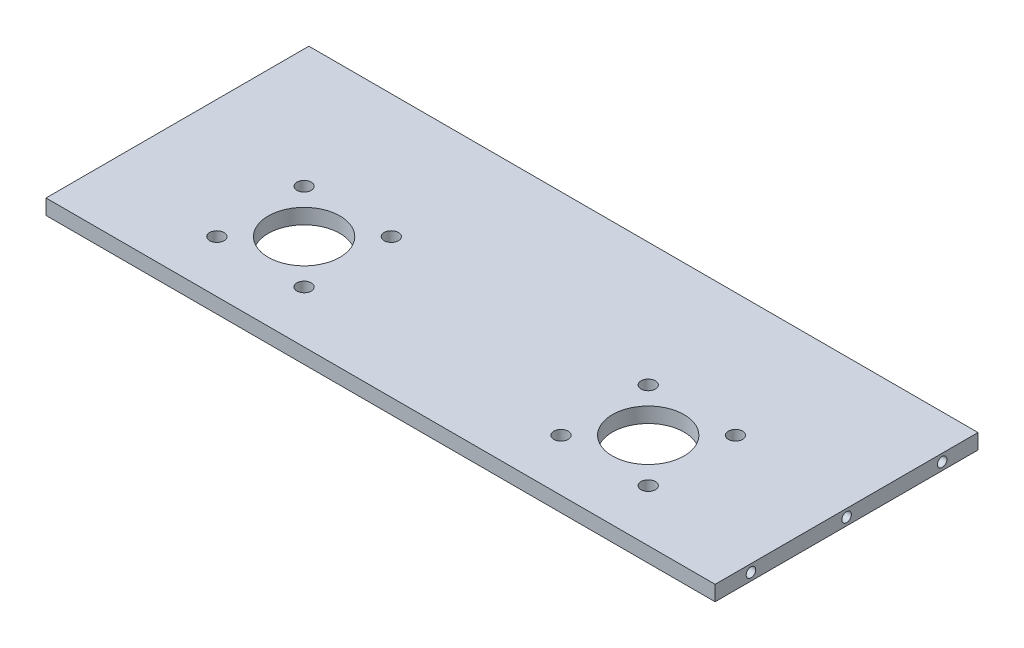
ISO-10303-21;
HEADER;
FILE_DESCRIPTION(('STEP AP214'),'2;1');
FILE_NAME('part.step','',(''),(''),'','','');
FILE_SCHEMA(('AUTOMOTIVE_DESIGN { 1 0 10303 214 1 1 1 1 }'));
ENDSEC;
DATA;
#1=APPLICATION_CONTEXT('core data for automotive mechanical design processes');
#2=APPLICATION_PROTOCOL_DEFINITION('international standard','automotive_design',2000,#1);
#3=PRODUCT_CONTEXT('',#1,'mechanical');
#4=PRODUCT('Part','Part','',(#3));
#5=PRODUCT_RELATED_PRODUCT_CATEGORY('part','',(#4));
#6=PRODUCT_DEFINITION_FORMATION('','',#4);
#7=PRODUCT_DEFINITION_CONTEXT('part definition',#1,'design');
#8=PRODUCT_DEFINITION('design','',#6,#7);
#9=PRODUCT_DEFINITION_SHAPE('','',#8);
#10=(LENGTH_UNIT() NAMED_UNIT(*) SI_UNIT(.MILLI.,.METRE.));
#11=(NAMED_UNIT(*) PLANE_ANGLE_UNIT() SI_UNIT($,.RADIAN.));
#12=(NAMED_UNIT(*) SI_UNIT($,.STERADIAN.) SOLID_ANGLE_UNIT());
#13=UNCERTAINTY_MEASURE_WITH_UNIT(LENGTH_MEASURE(1.E-05),#10,'distance_accuracy_value','');
#14=(GEOMETRIC_REPRESENTATION_CONTEXT(3) GLOBAL_UNCERTAINTY_ASSIGNED_CONTEXT((#13)) GLOBAL_UNIT_ASSIGNED_CONTEXT((#10,
#11,#12)) REPRESENTATION_CONTEXT('',''));
#15=CARTESIAN_POINT('',(0.,0.,0.));
#16=DIRECTION('',(0.,0.,1.));
#17=DIRECTION('',(1.,0.,0.));
#18=AXIS2_PLACEMENT_3D('',#15,#16,#17);
#19=CARTESIAN_POINT('',(0.,6.35,0.));
#20=DIRECTION('',(0.,1.,0.));
#21=DIRECTION('',(0.,0.,1.));
#22=AXIS2_PLACEMENT_3D('',#19,#20,#21);
#23=PLANE('',#22);
#24=CARTESIAN_POINT('',(104.544294294294,6.35,31.4932432432432));
#25=DIRECTION('',(0.,1.,0.));
#26=DIRECTION('',(0.,0.,1.));
#27=AXIS2_PLACEMENT_3D('',#24,#25,#26);
#28=CIRCLE('',#27,3.00000000000001);
#29=CARTESIAN_POINT('',(104.544294294294,6.35,34.4932432432432));
#30=VERTEX_POINT('',#29);
#31=EDGE_CURVE('E159',#30,#30,#28,.F.);
#32=ORIENTED_EDGE('',*,*,#31,.T.);
#33=EDGE_LOOP('',(#32));
#34=FACE_BOUND('',#33,.T.);
#35=CARTESIAN_POINT('',(104.544294294294,6.35,-5.00675675675667));
#36=DIRECTION('',(0.,1.,0.));
#37=DIRECTION('',(0.,0.,1.));
#38=AXIS2_PLACEMENT_3D('',#35,#36,#37);
#39=CIRCLE('',#38,3.00000000000001);
#40=CARTESIAN_POINT('',(104.544294294294,6.35,-2.00675675675666));
#41=VERTEX_POINT('',#40);
#42=EDGE_CURVE('E147',#41,#41,#39,.F.);
#43=ORIENTED_EDGE('',*,*,#42,.T.);
#44=EDGE_LOOP('',(#43));
#45=FACE_BOUND('',#44,.T.);
#46=CARTESIAN_POINT('',(-39.4557057057057,6.35,31.4932432432433));
#47=DIRECTION('',(0.,1.,0.));
#48=DIRECTION('',(0.,0.,1.));
#49=AXIS2_PLACEMENT_3D('',#46,#47,#48);
#50=CIRCLE('',#49,3.00000000000001);
#51=CARTESIAN_POINT('',(-39.4557057057057,6.35,34.4932432432433));
#52=VERTEX_POINT('',#51);
#53=EDGE_CURVE('E135',#52,#52,#50,.F.);
#54=ORIENTED_EDGE('',*,*,#53,.T.);
#55=EDGE_LOOP('',(#54));
#56=FACE_BOUND('',#55,.T.);
#57=CARTESIAN_POINT('',(86.2942942942943,6.35,13.2432432432432));
#58=DIRECTION('',(0.,1.,0.));
#59=DIRECTION('',(0.,0.,1.));
#60=AXIS2_PLACEMENT_3D('',#57,#58,#59);
#61=CIRCLE('',#60,15.);
#62=CARTESIAN_POINT('',(86.2942942942943,6.35,28.2432432432432));
#63=VERTEX_POINT('',#62);
#64=EDGE_CURVE('E123',#63,#63,#61,.F.);
#65=ORIENTED_EDGE('',*,*,#64,.T.);
#66=EDGE_LOOP('',(#65));
#67=FACE_BOUND('',#66,.T.);
#68=CARTESIAN_POINT('',(-39.4557057057057,6.35,-5.0067567567567));
#69=DIRECTION('',(0.,1.,0.));
#70=DIRECTION('',(0.,0.,1.));
#71=AXIS2_PLACEMENT_3D('',#68,#69,#70);
#72=CIRCLE('',#71,3.00000000000001);
#73=CARTESIAN_POINT('',(-39.4557057057057,6.35,-2.00675675675669));
#74=VERTEX_POINT('',#73);
#75=EDGE_CURVE('E100',#74,#74,#72,.F.);
#76=ORIENTED_EDGE('',*,*,#75,.T.);
#77=EDGE_LOOP('',(#76));
#78=FACE_BOUND('',#77,.T.);
#79=DIRECTION('',(0.,0.,1.));
#80=VECTOR('',#79,1.);
#81=CARTESIAN_POINT('',(-125.705705705706,6.35,-56.7567567567568));
#82=LINE('',#81,#80);
#83=CARTESIAN_POINT('',(-125.705705705706,6.35,-56.7567567567568));
#84=VERTEX_POINT('',#83);
#85=CARTESIAN_POINT('',(-125.705705705706,6.35,53.2432432432432));
#86=VERTEX_POINT('',#85);
#87=EDGE_CURVE('E85',#84,#86,#82,.T.);
#88=ORIENTED_EDGE('',*,*,#87,.T.);
#89=DIRECTION('',(1.,0.,0.));
#90=VECTOR('',#89,1.);
#91=CARTESIAN_POINT('',(-125.705705705706,6.35,53.2432432432432));
#92=LINE('',#91,#90);
#93=CARTESIAN_POINT('',(154.294294294294,6.35,53.2432432432432));
#94=VERTEX_POINT('',#93);
#95=EDGE_CURVE('E80',#86,#94,#92,.T.);
#96=ORIENTED_EDGE('',*,*,#95,.T.);
#97=DIRECTION('',(0.,0.,-1.));
#98=VECTOR('',#97,1.);
#99=CARTESIAN_POINT('',(154.294294294294,6.35,-56.7567567567568));
#100=LINE('',#99,#98);
#101=CARTESIAN_POINT('',(154.294294294294,6.35,-56.7567567567568));
#102=VERTEX_POINT('',#101);
#103=EDGE_CURVE('E83',#94,#102,#100,.T.);
#104=ORIENTED_EDGE('',*,*,#103,.T.);
#105=DIRECTION('',(-1.,0.,0.));
#106=VECTOR('',#105,1.);
#107=CARTESIAN_POINT('',(-125.705705705706,6.35,-56.7567567567568));
#108=LINE('',#107,#106);
#109=EDGE_CURVE('E50',#102,#84,#108,.T.);
#110=ORIENTED_EDGE('',*,*,#109,.T.);
#111=EDGE_LOOP('',(#88,#96,#104,#110));
#112=FACE_BOUND('',#111,.T.);
#113=CARTESIAN_POINT('',(-75.9557057057057,6.35,-5.00675675675669));
#114=DIRECTION('',(0.,1.,0.));
#115=DIRECTION('',(0.,0.,1.));
#116=AXIS2_PLACEMENT_3D('',#113,#114,#115);
#117=CIRCLE('',#116,3.00000000000001);
#118=CARTESIAN_POINT('',(-75.9557057057057,6.35,-2.00675675675669));
#119=VERTEX_POINT('',#118);
#120=EDGE_CURVE('E117',#119,#119,#117,.F.);
#121=ORIENTED_EDGE('',*,*,#120,.T.);
#122=EDGE_LOOP('',(#121));
#123=FACE_BOUND('',#122,.T.);
#124=CARTESIAN_POINT('',(-57.7057057057057,6.35,13.2432432432433));
#125=DIRECTION('',(0.,1.,0.));
#126=DIRECTION('',(0.,0.,1.));
#127=AXIS2_PLACEMENT_3D('',#124,#125,#126);
#128=CIRCLE('',#127,15.);
#129=CARTESIAN_POINT('',(-57.7057057057057,6.35,28.2432432432432));
#130=VERTEX_POINT('',#129);
#131=EDGE_CURVE('E129',#130,#130,#128,.F.);
#132=ORIENTED_EDGE('',*,*,#131,.T.);
#133=EDGE_LOOP('',(#132));
#134=FACE_BOUND('',#133,.T.);
#135=CARTESIAN_POINT('',(-75.9557057057057,6.35,31.4932432432433));
#136=DIRECTION('',(0.,1.,0.));
#137=DIRECTION('',(0.,0.,1.));
#138=AXIS2_PLACEMENT_3D('',#135,#136,#137);
#139=CIRCLE('',#138,3.00000000000001);
#140=CARTESIAN_POINT('',(-75.9557057057057,6.35,34.4932432432433));
#141=VERTEX_POINT('',#140);
#142=EDGE_CURVE('E141',#141,#141,#139,.F.);
#143=ORIENTED_EDGE('',*,*,#142,.T.);
#144=EDGE_LOOP('',(#143));
#145=FACE_BOUND('',#144,.T.);
#146=CARTESIAN_POINT('',(68.0442942942943,6.35,-5.00675675675667));
#147=DIRECTION('',(0.,1.,0.));
#148=DIRECTION('',(0.,0.,1.));
#149=AXIS2_PLACEMENT_3D('',#146,#147,#148);
#150=CIRCLE('',#149,3.00000000000001);
#151=CARTESIAN_POINT('',(68.0442942942943,6.35,-2.00675675675666));
#152=VERTEX_POINT('',#151);
#153=EDGE_CURVE('E153',#152,#152,#150,.F.);
#154=ORIENTED_EDGE('',*,*,#153,.T.);
#155=EDGE_LOOP('',(#154));
#156=FACE_BOUND('',#155,.T.);
#157=CARTESIAN_POINT('',(68.0442942942943,6.35,31.4932432432432));
#158=DIRECTION('',(0.,1.,0.));
#159=DIRECTION('',(0.,0.,1.));
#160=AXIS2_PLACEMENT_3D('',#157,#158,#159);
#161=CIRCLE('',#160,3.00000000000001);
#162=CARTESIAN_POINT('',(68.0442942942943,6.35,34.4932432432432));
#163=VERTEX_POINT('',#162);
#164=EDGE_CURVE('E165',#163,#163,#161,.F.);
#165=ORIENTED_EDGE('',*,*,#164,.T.);
#166=EDGE_LOOP('',(#165));
#167=FACE_BOUND('',#166,.T.);
#168=ADVANCED_FACE('F33',(#34,#45,#56,#67,#78,#112,#123,#134,#145,#156,#167),#23,.T.);
#169=CARTESIAN_POINT('',(0.,0.,0.));
#170=DIRECTION('',(0.,1.,0.));
#171=DIRECTION('',(0.,0.,1.));
#172=AXIS2_PLACEMENT_3D('',#169,#170,#171);
#173=PLANE('',#172);
#174=CARTESIAN_POINT('',(104.544294294294,0.,31.4932432432432));
#175=DIRECTION('',(0.,1.,0.));
#176=DIRECTION('',(0.,0.,1.));
#177=AXIS2_PLACEMENT_3D('',#174,#175,#176);
#178=CIRCLE('',#177,3.00000000000001);
#179=CARTESIAN_POINT('',(104.544294294294,0.,34.4932432432432));
#180=VERTEX_POINT('',#179);
#181=EDGE_CURVE('E162',#180,#180,#178,.T.);
#182=ORIENTED_EDGE('',*,*,#181,.T.);
#183=EDGE_LOOP('',(#182));
#184=FACE_BOUND('',#183,.T.);
#185=CARTESIAN_POINT('',(104.544294294294,0.,-5.00675675675667));
#186=DIRECTION('',(0.,1.,0.));
#187=DIRECTION('',(0.,0.,1.));
#188=AXIS2_PLACEMENT_3D('',#185,#186,#187);
#189=CIRCLE('',#188,3.00000000000001);
#190=CARTESIAN_POINT('',(104.544294294294,0.,-2.00675675675666));
#191=VERTEX_POINT('',#190);
#192=EDGE_CURVE('E150',#191,#191,#189,.T.);
#193=ORIENTED_EDGE('',*,*,#192,.T.);
#194=EDGE_LOOP('',(#193));
#195=FACE_BOUND('',#194,.T.);
#196=CARTESIAN_POINT('',(-39.4557057057057,0.,31.4932432432433));
#197=DIRECTION('',(0.,1.,0.));
#198=DIRECTION('',(0.,0.,1.));
#199=AXIS2_PLACEMENT_3D('',#196,#197,#198);
#200=CIRCLE('',#199,3.00000000000001);
#201=CARTESIAN_POINT('',(-39.4557057057057,0.,34.4932432432433));
#202=VERTEX_POINT('',#201);
#203=EDGE_CURVE('E138',#202,#202,#200,.T.);
#204=ORIENTED_EDGE('',*,*,#203,.T.);
#205=EDGE_LOOP('',(#204));
#206=FACE_BOUND('',#205,.T.);
#207=CARTESIAN_POINT('',(86.2942942942943,0.,13.2432432432432));
#208=DIRECTION('',(0.,1.,0.));
#209=DIRECTION('',(0.,0.,1.));
#210=AXIS2_PLACEMENT_3D('',#207,#208,#209);
#211=CIRCLE('',#210,15.);
#212=CARTESIAN_POINT('',(86.2942942942943,0.,28.2432432432432));
#213=VERTEX_POINT('',#212);
#214=EDGE_CURVE('E126',#213,#213,#211,.T.);
#215=ORIENTED_EDGE('',*,*,#214,.T.);
#216=EDGE_LOOP('',(#215));
#217=FACE_BOUND('',#216,.T.);
#218=CARTESIAN_POINT('',(-39.4557057057057,0.,-5.0067567567567));
#219=DIRECTION('',(0.,1.,0.));
#220=DIRECTION('',(0.,0.,1.));
#221=AXIS2_PLACEMENT_3D('',#218,#219,#220);
#222=CIRCLE('',#221,3.00000000000001);
#223=CARTESIAN_POINT('',(-39.4557057057057,0.,-2.00675675675669));
#224=VERTEX_POINT('',#223);
#225=EDGE_CURVE('E114',#224,#224,#222,.T.);
#226=ORIENTED_EDGE('',*,*,#225,.T.);
#227=EDGE_LOOP('',(#226));
#228=FACE_BOUND('',#227,.T.);
#229=DIRECTION('',(0.,0.,1.));
#230=VECTOR('',#229,1.);
#231=CARTESIAN_POINT('',(-125.705705705706,0.,-56.7567567567568));
#232=LINE('',#231,#230);
#233=CARTESIAN_POINT('',(-125.705705705706,0.,-56.7567567567568));
#234=VERTEX_POINT('',#233);
#235=CARTESIAN_POINT('',(-125.705705705706,0.,53.2432432432432));
#236=VERTEX_POINT('',#235);
#237=EDGE_CURVE('E97',#234,#236,#232,.T.);
#238=ORIENTED_EDGE('',*,*,#237,.F.);
#239=DIRECTION('',(-1.,0.,0.));
#240=VECTOR('',#239,1.);
#241=CARTESIAN_POINT('',(-125.705705705706,0.,-56.7567567567568));
#242=LINE('',#241,#240);
#243=CARTESIAN_POINT('',(154.294294294294,0.,-56.7567567567568));
#244=VERTEX_POINT('',#243);
#245=EDGE_CURVE('E73',#244,#234,#242,.T.);
#246=ORIENTED_EDGE('',*,*,#245,.F.);
#247=DIRECTION('',(0.,0.,-1.));
#248=VECTOR('',#247,1.);
#249=CARTESIAN_POINT('',(154.294294294294,0.,-56.7567567567568));
#250=LINE('',#249,#248);
#251=CARTESIAN_POINT('',(154.294294294294,0.,53.2432432432432));
#252=VERTEX_POINT('',#251);
#253=EDGE_CURVE('E67',#252,#244,#250,.T.);
#254=ORIENTED_EDGE('',*,*,#253,.F.);
#255=DIRECTION('',(1.,0.,0.));
#256=VECTOR('',#255,1.);
#257=CARTESIAN_POINT('',(-125.705705705706,0.,53.2432432432432));
#258=LINE('',#257,#256);
#259=EDGE_CURVE('E89',#236,#252,#258,.T.);
#260=ORIENTED_EDGE('',*,*,#259,.F.);
#261=EDGE_LOOP('',(#238,#246,#254,#260));
#262=FACE_BOUND('',#261,.T.);
#263=CARTESIAN_POINT('',(-75.9557057057057,0.,-5.00675675675669));
#264=DIRECTION('',(0.,1.,0.));
#265=DIRECTION('',(0.,0.,1.));
#266=AXIS2_PLACEMENT_3D('',#263,#264,#265);
#267=CIRCLE('',#266,3.00000000000001);
#268=CARTESIAN_POINT('',(-75.9557057057057,0.,-2.00675675675669));
#269=VERTEX_POINT('',#268);
#270=EDGE_CURVE('E120',#269,#269,#267,.T.);
#271=ORIENTED_EDGE('',*,*,#270,.T.);
#272=EDGE_LOOP('',(#271));
#273=FACE_BOUND('',#272,.T.);
#274=CARTESIAN_POINT('',(-57.7057057057057,0.,13.2432432432433));
#275=DIRECTION('',(0.,1.,0.));
#276=DIRECTION('',(0.,0.,1.));
#277=AXIS2_PLACEMENT_3D('',#274,#275,#276);
#278=CIRCLE('',#277,15.);
#279=CARTESIAN_POINT('',(-57.7057057057057,0.,28.2432432432432));
#280=VERTEX_POINT('',#279);
#281=EDGE_CURVE('E132',#280,#280,#278,.T.);
#282=ORIENTED_EDGE('',*,*,#281,.T.);
#283=EDGE_LOOP('',(#282));
#284=FACE_BOUND('',#283,.T.);
#285=CARTESIAN_POINT('',(-75.9557057057057,0.,31.4932432432433));
#286=DIRECTION('',(0.,1.,0.));
#287=DIRECTION('',(0.,0.,1.));
#288=AXIS2_PLACEMENT_3D('',#285,#286,#287);
#289=CIRCLE('',#288,3.00000000000001);
#290=CARTESIAN_POINT('',(-75.9557057057057,0.,34.4932432432433));
#291=VERTEX_POINT('',#290);
#292=EDGE_CURVE('E144',#291,#291,#289,.T.);
#293=ORIENTED_EDGE('',*,*,#292,.T.);
#294=EDGE_LOOP('',(#293));
#295=FACE_BOUND('',#294,.T.);
#296=CARTESIAN_POINT('',(68.0442942942943,0.,-5.00675675675667));
#297=DIRECTION('',(0.,1.,0.));
#298=DIRECTION('',(0.,0.,1.));
#299=AXIS2_PLACEMENT_3D('',#296,#297,#298);
#300=CIRCLE('',#299,3.00000000000001);
#301=CARTESIAN_POINT('',(68.0442942942943,0.,-2.00675675675666));
#302=VERTEX_POINT('',#301);
#303=EDGE_CURVE('E156',#302,#302,#300,.T.);
#304=ORIENTED_EDGE('',*,*,#303,.T.);
#305=EDGE_LOOP('',(#304));
#306=FACE_BOUND('',#305,.T.);
#307=CARTESIAN_POINT('',(68.0442942942943,0.,31.4932432432432));
#308=DIRECTION('',(0.,1.,0.));
#309=DIRECTION('',(0.,0.,1.));
#310=AXIS2_PLACEMENT_3D('',#307,#308,#309);
#311=CIRCLE('',#310,3.00000000000001);
#312=CARTESIAN_POINT('',(68.0442942942943,0.,34.4932432432432));
#313=VERTEX_POINT('',#312);
#314=EDGE_CURVE('E168',#313,#313,#311,.T.);
#315=ORIENTED_EDGE('',*,*,#314,.T.);
#316=EDGE_LOOP('',(#315));
#317=FACE_BOUND('',#316,.T.);
#318=ADVANCED_FACE('F108',(#184,#195,#206,#217,#228,#262,#273,#284,#295,#306,#317),#173,.F.);
#319=CARTESIAN_POINT('',(-125.705705705706,6.35,-56.7567567567568));
#320=DIRECTION('',(1.,0.,0.));
#321=DIRECTION('',(0.,0.,-1.));
#322=AXIS2_PLACEMENT_3D('',#319,#320,#321);
#323=PLANE('',#322);
#324=CARTESIAN_POINT('',(-125.705705705706,3.175,-1.75675675675677));
#325=DIRECTION('',(-1.,0.,0.));
#326=DIRECTION('',(0.,0.,1.));
#327=AXIS2_PLACEMENT_3D('',#324,#325,#326);
#328=CIRCLE('',#327,2.);
#329=CARTESIAN_POINT('',(-125.705705705706,3.175,0.24324324324323));
#330=VERTEX_POINT('',#329);
#331=EDGE_CURVE('E184',#330,#330,#328,.T.);
#332=ORIENTED_EDGE('',*,*,#331,.F.);
#333=EDGE_LOOP('',(#332));
#334=FACE_BOUND('',#333,.T.);
#335=CARTESIAN_POINT('',(-125.705705705706,3.175,-41.7567567567568));
#336=DIRECTION('',(-1.,0.,0.));
#337=DIRECTION('',(0.,0.,1.));
#338=AXIS2_PLACEMENT_3D('',#335,#336,#337);
#339=CIRCLE('',#338,2.);
#340=CARTESIAN_POINT('',(-125.705705705706,3.175,-39.7567567567568));
#341=VERTEX_POINT('',#340);
#342=EDGE_CURVE('E178',#341,#341,#339,.T.);
#343=ORIENTED_EDGE('',*,*,#342,.F.);
#344=EDGE_LOOP('',(#343));
#345=FACE_BOUND('',#344,.T.);
#346=CARTESIAN_POINT('',(-125.705705705706,3.175,38.2432432432432));
#347=DIRECTION('',(-1.,0.,0.));
#348=DIRECTION('',(0.,0.,1.));
#349=AXIS2_PLACEMENT_3D('',#346,#347,#348);
#350=CIRCLE('',#349,2.);
#351=CARTESIAN_POINT('',(-125.705705705706,3.175,40.2432432432432));
#352=VERTEX_POINT('',#351);
#353=EDGE_CURVE('E172',#352,#352,#350,.T.);
#354=ORIENTED_EDGE('',*,*,#353,.F.);
#355=EDGE_LOOP('',(#354));
#356=FACE_BOUND('',#355,.T.);
#357=ORIENTED_EDGE('',*,*,#237,.T.);
#358=DIRECTION('',(0.,-1.,0.));
#359=VECTOR('',#358,1.);
#360=CARTESIAN_POINT('',(-125.705705705706,6.35,53.2432432432432));
#361=LINE('',#360,#359);
#362=EDGE_CURVE('E11',#86,#236,#361,.T.);
#363=ORIENTED_EDGE('',*,*,#362,.F.);
#364=ORIENTED_EDGE('',*,*,#87,.F.);
#365=DIRECTION('',(0.,-1.,0.));
#366=VECTOR('',#365,1.);
#367=CARTESIAN_POINT('',(-125.705705705706,6.35,-56.7567567567568));
#368=LINE('',#367,#366);
#369=EDGE_CURVE('E93',#84,#234,#368,.T.);
#370=ORIENTED_EDGE('',*,*,#369,.T.);
#371=EDGE_LOOP('',(#357,#363,#364,#370));
#372=FACE_BOUND('',#371,.T.);
#373=ADVANCED_FACE('F35',(#334,#345,#356,#372),#323,.F.);
#374=CARTESIAN_POINT('',(-125.705705705706,6.35,53.2432432432432));
#375=DIRECTION('',(0.,0.,-1.));
#376=DIRECTION('',(-1.,0.,0.));
#377=AXIS2_PLACEMENT_3D('',#374,#375,#376);
#378=PLANE('',#377);
#379=ORIENTED_EDGE('',*,*,#259,.T.);
#380=DIRECTION('',(0.,-1.,0.));
#381=VECTOR('',#380,1.);
#382=CARTESIAN_POINT('',(154.294294294294,6.35,53.2432432432432));
#383=LINE('',#382,#381);
#384=EDGE_CURVE('E42',#94,#252,#383,.T.);
#385=ORIENTED_EDGE('',*,*,#384,.F.);
#386=ORIENTED_EDGE('',*,*,#95,.F.);
#387=ORIENTED_EDGE('',*,*,#362,.T.);
#388=EDGE_LOOP('',(#379,#385,#386,#387));
#389=FACE_BOUND('',#388,.T.);
#390=ADVANCED_FACE('F88',(#389),#378,.F.);
#391=CARTESIAN_POINT('',(154.294294294294,6.35,-56.7567567567568));
#392=DIRECTION('',(-1.,0.,0.));
#393=DIRECTION('',(0.,0.,1.));
#394=AXIS2_PLACEMENT_3D('',#391,#392,#393);
#395=PLANE('',#394);
#396=CARTESIAN_POINT('',(154.294294294294,3.175,-1.75675675675676));
#397=DIRECTION('',(1.,0.,0.));
#398=DIRECTION('',(0.,0.,-1.));
#399=AXIS2_PLACEMENT_3D('',#396,#397,#398);
#400=CIRCLE('',#399,2.);
#401=CARTESIAN_POINT('',(154.294294294294,3.175,-3.75675675675676));
#402=VERTEX_POINT('',#401);
#403=EDGE_CURVE('E202',#402,#402,#400,.T.);
#404=ORIENTED_EDGE('',*,*,#403,.F.);
#405=EDGE_LOOP('',(#404));
#406=FACE_BOUND('',#405,.T.);
#407=CARTESIAN_POINT('',(154.294294294294,3.175,38.2432432432432));
#408=DIRECTION('',(1.,0.,0.));
#409=DIRECTION('',(0.,0.,-1.));
#410=AXIS2_PLACEMENT_3D('',#407,#408,#409);
#411=CIRCLE('',#410,2.);
#412=CARTESIAN_POINT('',(154.294294294294,3.175,36.2432432432432));
#413=VERTEX_POINT('',#412);
#414=EDGE_CURVE('E196',#413,#413,#411,.T.);
#415=ORIENTED_EDGE('',*,*,#414,.F.);
#416=EDGE_LOOP('',(#415));
#417=FACE_BOUND('',#416,.T.);
#418=CARTESIAN_POINT('',(154.294294294294,3.175,-41.7567567567568));
#419=DIRECTION('',(1.,0.,0.));
#420=DIRECTION('',(0.,0.,-1.));
#421=AXIS2_PLACEMENT_3D('',#418,#419,#420);
#422=CIRCLE('',#421,2.);
#423=CARTESIAN_POINT('',(154.294294294294,3.175,-43.7567567567568));
#424=VERTEX_POINT('',#423);
#425=EDGE_CURVE('E190',#424,#424,#422,.T.);
#426=ORIENTED_EDGE('',*,*,#425,.F.);
#427=EDGE_LOOP('',(#426));
#428=FACE_BOUND('',#427,.T.);
#429=ORIENTED_EDGE('',*,*,#253,.T.);
#430=DIRECTION('',(0.,-1.,0.));
#431=VECTOR('',#430,1.);
#432=CARTESIAN_POINT('',(154.294294294294,6.35,-56.7567567567568));
#433=LINE('',#432,#431);
#434=EDGE_CURVE('E90',#102,#244,#433,.T.);
#435=ORIENTED_EDGE('',*,*,#434,.F.);
#436=ORIENTED_EDGE('',*,*,#103,.F.);
#437=ORIENTED_EDGE('',*,*,#384,.T.);
#438=EDGE_LOOP('',(#429,#435,#436,#437));
#439=FACE_BOUND('',#438,.T.);
#440=ADVANCED_FACE('F91',(#406,#417,#428,#439),#395,.F.);
#441=CARTESIAN_POINT('',(-125.705705705706,6.35,-56.7567567567568));
#442=DIRECTION('',(0.,0.,1.));
#443=DIRECTION('',(1.,0.,0.));
#444=AXIS2_PLACEMENT_3D('',#441,#442,#443);
#445=PLANE('',#444);
#446=ORIENTED_EDGE('',*,*,#245,.T.);
#447=ORIENTED_EDGE('',*,*,#369,.F.);
#448=ORIENTED_EDGE('',*,*,#109,.F.);
#449=ORIENTED_EDGE('',*,*,#434,.T.);
#450=EDGE_LOOP('',(#446,#447,#448,#449));
#451=FACE_BOUND('',#450,.T.);
#452=ADVANCED_FACE('F105',(#451),#445,.F.);
#453=CARTESIAN_POINT('',(-39.4557057057057,20.,-5.0067567567567));
#454=DIRECTION('',(0.,-1.,0.));
#455=DIRECTION('',(0.,0.,-1.));
#456=AXIS2_PLACEMENT_3D('',#453,#454,#455);
#457=CYLINDRICAL_SURFACE('',#456,3.00000000000001);
#458=ORIENTED_EDGE('',*,*,#75,.F.);
#459=EDGE_LOOP('',(#458));
#460=FACE_BOUND('',#459,.T.);
#461=ORIENTED_EDGE('',*,*,#225,.F.);
#462=EDGE_LOOP('',(#461));
#463=FACE_BOUND('',#462,.T.);
#464=ADVANCED_FACE('F251',(#460,#463),#457,.F.);
#465=CARTESIAN_POINT('',(-75.9557057057057,20.,-5.00675675675669));
#466=DIRECTION('',(0.,-1.,0.));
#467=DIRECTION('',(0.,0.,-1.));
#468=AXIS2_PLACEMENT_3D('',#465,#466,#467);
#469=CYLINDRICAL_SURFACE('',#468,3.00000000000001);
#470=ORIENTED_EDGE('',*,*,#120,.F.);
#471=EDGE_LOOP('',(#470));
#472=FACE_BOUND('',#471,.T.);
#473=ORIENTED_EDGE('',*,*,#270,.F.);
#474=EDGE_LOOP('',(#473));
#475=FACE_BOUND('',#474,.T.);
#476=ADVANCED_FACE('F312',(#472,#475),#469,.F.);
#477=CARTESIAN_POINT('',(86.2942942942943,20.,13.2432432432432));
#478=DIRECTION('',(0.,-1.,0.));
#479=DIRECTION('',(0.,0.,-1.));
#480=AXIS2_PLACEMENT_3D('',#477,#478,#479);
#481=CYLINDRICAL_SURFACE('',#480,15.);
#482=ORIENTED_EDGE('',*,*,#64,.F.);
#483=EDGE_LOOP('',(#482));
#484=FACE_BOUND('',#483,.T.);
#485=ORIENTED_EDGE('',*,*,#214,.F.);
#486=EDGE_LOOP('',(#485));
#487=FACE_BOUND('',#486,.T.);
#488=ADVANCED_FACE('F309',(#484,#487),#481,.F.);
#489=CARTESIAN_POINT('',(-57.7057057057057,20.,13.2432432432433));
#490=DIRECTION('',(0.,-1.,0.));
#491=DIRECTION('',(0.,0.,-1.));
#492=AXIS2_PLACEMENT_3D('',#489,#490,#491);
#493=CYLINDRICAL_SURFACE('',#492,15.);
#494=ORIENTED_EDGE('',*,*,#131,.F.);
#495=EDGE_LOOP('',(#494));
#496=FACE_BOUND('',#495,.T.);
#497=ORIENTED_EDGE('',*,*,#281,.F.);
#498=EDGE_LOOP('',(#497));
#499=FACE_BOUND('',#498,.T.);
#500=ADVANCED_FACE('F305',(#496,#499),#493,.F.);
#501=CARTESIAN_POINT('',(-39.4557057057057,20.,31.4932432432433));
#502=DIRECTION('',(0.,-1.,0.));
#503=DIRECTION('',(0.,0.,-1.));
#504=AXIS2_PLACEMENT_3D('',#501,#502,#503);
#505=CYLINDRICAL_SURFACE('',#504,3.00000000000001);
#506=ORIENTED_EDGE('',*,*,#53,.F.);
#507=EDGE_LOOP('',(#506));
#508=FACE_BOUND('',#507,.T.);
#509=ORIENTED_EDGE('',*,*,#203,.F.);
#510=EDGE_LOOP('',(#509));
#511=FACE_BOUND('',#510,.T.);
#512=ADVANCED_FACE('F301',(#508,#511),#505,.F.);
#513=CARTESIAN_POINT('',(-75.9557057057057,20.,31.4932432432433));
#514=DIRECTION('',(0.,-1.,0.));
#515=DIRECTION('',(0.,0.,-1.));
#516=AXIS2_PLACEMENT_3D('',#513,#514,#515);
#517=CYLINDRICAL_SURFACE('',#516,3.00000000000001);
#518=ORIENTED_EDGE('',*,*,#142,.F.);
#519=EDGE_LOOP('',(#518));
#520=FACE_BOUND('',#519,.T.);
#521=ORIENTED_EDGE('',*,*,#292,.F.);
#522=EDGE_LOOP('',(#521));
#523=FACE_BOUND('',#522,.T.);
#524=ADVANCED_FACE('F297',(#520,#523),#517,.F.);
#525=CARTESIAN_POINT('',(104.544294294294,20.,-5.00675675675667));
#526=DIRECTION('',(0.,-1.,0.));
#527=DIRECTION('',(0.,0.,-1.));
#528=AXIS2_PLACEMENT_3D('',#525,#526,#527);
#529=CYLINDRICAL_SURFACE('',#528,3.00000000000001);
#530=ORIENTED_EDGE('',*,*,#42,.F.);
#531=EDGE_LOOP('',(#530));
#532=FACE_BOUND('',#531,.T.);
#533=ORIENTED_EDGE('',*,*,#192,.F.);
#534=EDGE_LOOP('',(#533));
#535=FACE_BOUND('',#534,.T.);
#536=ADVANCED_FACE('F293',(#532,#535),#529,.F.);
#537=CARTESIAN_POINT('',(68.0442942942943,20.,-5.00675675675667));
#538=DIRECTION('',(0.,-1.,0.));
#539=DIRECTION('',(0.,0.,-1.));
#540=AXIS2_PLACEMENT_3D('',#537,#538,#539);
#541=CYLINDRICAL_SURFACE('',#540,3.00000000000001);
#542=ORIENTED_EDGE('',*,*,#153,.F.);
#543=EDGE_LOOP('',(#542));
#544=FACE_BOUND('',#543,.T.);
#545=ORIENTED_EDGE('',*,*,#303,.F.);
#546=EDGE_LOOP('',(#545));
#547=FACE_BOUND('',#546,.T.);
#548=ADVANCED_FACE('F289',(#544,#547),#541,.F.);
#549=CARTESIAN_POINT('',(104.544294294294,20.,31.4932432432432));
#550=DIRECTION('',(0.,-1.,0.));
#551=DIRECTION('',(0.,0.,-1.));
#552=AXIS2_PLACEMENT_3D('',#549,#550,#551);
#553=CYLINDRICAL_SURFACE('',#552,3.00000000000001);
#554=ORIENTED_EDGE('',*,*,#31,.F.);
#555=EDGE_LOOP('',(#554));
#556=FACE_BOUND('',#555,.T.);
#557=ORIENTED_EDGE('',*,*,#181,.F.);
#558=EDGE_LOOP('',(#557));
#559=FACE_BOUND('',#558,.T.);
#560=ADVANCED_FACE('F281',(#556,#559),#553,.F.);
#561=CARTESIAN_POINT('',(68.0442942942943,20.,31.4932432432432));
#562=DIRECTION('',(0.,-1.,0.));
#563=DIRECTION('',(0.,0.,-1.));
#564=AXIS2_PLACEMENT_3D('',#561,#562,#563);
#565=CYLINDRICAL_SURFACE('',#564,3.00000000000001);
#566=ORIENTED_EDGE('',*,*,#164,.F.);
#567=EDGE_LOOP('',(#566));
#568=FACE_BOUND('',#567,.T.);
#569=ORIENTED_EDGE('',*,*,#314,.F.);
#570=EDGE_LOOP('',(#569));
#571=FACE_BOUND('',#570,.T.);
#572=ADVANCED_FACE('F271',(#568,#571),#565,.F.);
#573=CARTESIAN_POINT('',(-95.7057057057057,3.175,38.2432432432432));
#574=DIRECTION('',(-1.,0.,0.));
#575=DIRECTION('',(0.,0.,1.));
#576=AXIS2_PLACEMENT_3D('',#573,#574,#575);
#577=CYLINDRICAL_SURFACE('',#576,2.);
#578=CARTESIAN_POINT('',(-95.7057057057057,3.175,38.2432432432432));
#579=DIRECTION('',(-1.,0.,0.));
#580=DIRECTION('',(0.,0.,1.));
#581=AXIS2_PLACEMENT_3D('',#578,#579,#580);
#582=CIRCLE('',#581,2.);
#583=CARTESIAN_POINT('',(-95.7057057057057,3.175,40.2432432432432));
#584=VERTEX_POINT('',#583);
#585=EDGE_CURVE('E171',#584,#584,#582,.T.);
#586=ORIENTED_EDGE('',*,*,#585,.F.);
#587=EDGE_LOOP('',(#586));
#588=FACE_BOUND('',#587,.T.);
#589=ORIENTED_EDGE('',*,*,#353,.T.);
#590=EDGE_LOOP('',(#589));
#591=FACE_BOUND('',#590,.T.);
#592=ADVANCED_FACE('F268',(#588,#591),#577,.F.);
#593=CARTESIAN_POINT('',(-95.7057057057057,3.175,38.2432432432432));
#594=DIRECTION('',(-1.,0.,0.));
#595=DIRECTION('',(0.,0.,1.));
#596=AXIS2_PLACEMENT_3D('',#593,#594,#595);
#597=PLANE('',#596);
#598=ORIENTED_EDGE('',*,*,#585,.T.);
#599=EDGE_LOOP('',(#598));
#600=FACE_BOUND('',#599,.T.);
#601=ADVANCED_FACE('F270',(#600),#597,.T.);
#602=CARTESIAN_POINT('',(-95.7057057057057,3.175,-41.7567567567568));
#603=DIRECTION('',(-1.,0.,0.));
#604=DIRECTION('',(0.,0.,1.));
#605=AXIS2_PLACEMENT_3D('',#602,#603,#604);
#606=CYLINDRICAL_SURFACE('',#605,2.);
#607=CARTESIAN_POINT('',(-95.7057057057057,3.175,-41.7567567567568));
#608=DIRECTION('',(-1.,0.,0.));
#609=DIRECTION('',(0.,0.,1.));
#610=AXIS2_PLACEMENT_3D('',#607,#608,#609);
#611=CIRCLE('',#610,2.);
#612=CARTESIAN_POINT('',(-95.7057057057057,3.175,-39.7567567567568));
#613=VERTEX_POINT('',#612);
#614=EDGE_CURVE('E175',#613,#613,#611,.T.);
#615=ORIENTED_EDGE('',*,*,#614,.F.);
#616=EDGE_LOOP('',(#615));
#617=FACE_BOUND('',#616,.T.);
#618=ORIENTED_EDGE('',*,*,#342,.T.);
#619=EDGE_LOOP('',(#618));
#620=FACE_BOUND('',#619,.T.);
#621=ADVANCED_FACE('F278',(#617,#620),#606,.F.);
#622=CARTESIAN_POINT('',(-95.7057057057057,3.175,-41.7567567567568));
#623=DIRECTION('',(-1.,0.,0.));
#624=DIRECTION('',(0.,0.,1.));
#625=AXIS2_PLACEMENT_3D('',#622,#623,#624);
#626=PLANE('',#625);
#627=ORIENTED_EDGE('',*,*,#614,.T.);
#628=EDGE_LOOP('',(#627));
#629=FACE_BOUND('',#628,.T.);
#630=ADVANCED_FACE('F419',(#629),#626,.T.);
#631=CARTESIAN_POINT('',(-95.7057057057057,3.175,-1.75675675675678));
#632=DIRECTION('',(-1.,0.,0.));
#633=DIRECTION('',(0.,0.,1.));
#634=AXIS2_PLACEMENT_3D('',#631,#632,#633);
#635=CYLINDRICAL_SURFACE('',#634,2.);
#636=CARTESIAN_POINT('',(-95.7057057057057,3.175,-1.75675675675678));
#637=DIRECTION('',(-1.,0.,0.));
#638=DIRECTION('',(0.,0.,1.));
#639=AXIS2_PLACEMENT_3D('',#636,#637,#638);
#640=CIRCLE('',#639,2.);
#641=CARTESIAN_POINT('',(-95.7057057057057,3.175,0.243243243243223));
#642=VERTEX_POINT('',#641);
#643=EDGE_CURVE('E181',#642,#642,#640,.T.);
#644=ORIENTED_EDGE('',*,*,#643,.F.);
#645=EDGE_LOOP('',(#644));
#646=FACE_BOUND('',#645,.T.);
#647=ORIENTED_EDGE('',*,*,#331,.T.);
#648=EDGE_LOOP('',(#647));
#649=FACE_BOUND('',#648,.T.);
#650=ADVANCED_FACE('F237',(#646,#649),#635,.F.);
#651=CARTESIAN_POINT('',(-95.7057057057057,3.175,-1.75675675675678));
#652=DIRECTION('',(-1.,0.,0.));
#653=DIRECTION('',(0.,0.,1.));
#654=AXIS2_PLACEMENT_3D('',#651,#652,#653);
#655=PLANE('',#654);
#656=ORIENTED_EDGE('',*,*,#643,.T.);
#657=EDGE_LOOP('',(#656));
#658=FACE_BOUND('',#657,.T.);
#659=ADVANCED_FACE('F227',(#658),#655,.T.);
#660=CARTESIAN_POINT('',(124.294294294294,3.175,-41.7567567567568));
#661=DIRECTION('',(1.,0.,0.));
#662=DIRECTION('',(0.,0.,-1.));
#663=AXIS2_PLACEMENT_3D('',#660,#661,#662);
#664=CYLINDRICAL_SURFACE('',#663,2.);
#665=CARTESIAN_POINT('',(124.294294294294,3.175,-41.7567567567568));
#666=DIRECTION('',(1.,0.,0.));
#667=DIRECTION('',(0.,0.,-1.));
#668=AXIS2_PLACEMENT_3D('',#665,#666,#667);
#669=CIRCLE('',#668,2.);
#670=CARTESIAN_POINT('',(124.294294294294,3.175,-43.7567567567568));
#671=VERTEX_POINT('',#670);
#672=EDGE_CURVE('E187',#671,#671,#669,.T.);
#673=ORIENTED_EDGE('',*,*,#672,.F.);
#674=EDGE_LOOP('',(#673));
#675=FACE_BOUND('',#674,.T.);
#676=ORIENTED_EDGE('',*,*,#425,.T.);
#677=EDGE_LOOP('',(#676));
#678=FACE_BOUND('',#677,.T.);
#679=ADVANCED_FACE('F224',(#675,#678),#664,.F.);
#680=CARTESIAN_POINT('',(124.294294294294,3.175,-41.7567567567568));
#681=DIRECTION('',(1.,0.,0.));
#682=DIRECTION('',(0.,0.,-1.));
#683=AXIS2_PLACEMENT_3D('',#680,#681,#682);
#684=PLANE('',#683);
#685=ORIENTED_EDGE('',*,*,#672,.T.);
#686=EDGE_LOOP('',(#685));
#687=FACE_BOUND('',#686,.T.);
#688=ADVANCED_FACE('F226',(#687),#684,.T.);
#689=CARTESIAN_POINT('',(124.294294294294,3.175,38.2432432432432));
#690=DIRECTION('',(1.,0.,0.));
#691=DIRECTION('',(0.,0.,-1.));
#692=AXIS2_PLACEMENT_3D('',#689,#690,#691);
#693=CYLINDRICAL_SURFACE('',#692,2.);
#694=CARTESIAN_POINT('',(124.294294294294,3.175,38.2432432432432));
#695=DIRECTION('',(1.,0.,0.));
#696=DIRECTION('',(0.,0.,-1.));
#697=AXIS2_PLACEMENT_3D('',#694,#695,#696);
#698=CIRCLE('',#697,2.);
#699=CARTESIAN_POINT('',(124.294294294294,3.175,36.2432432432432));
#700=VERTEX_POINT('',#699);
#701=EDGE_CURVE('E193',#700,#700,#698,.T.);
#702=ORIENTED_EDGE('',*,*,#701,.F.);
#703=EDGE_LOOP('',(#702));
#704=FACE_BOUND('',#703,.T.);
#705=ORIENTED_EDGE('',*,*,#414,.T.);
#706=EDGE_LOOP('',(#705));
#707=FACE_BOUND('',#706,.T.);
#708=ADVANCED_FACE('F234',(#704,#707),#693,.F.);
#709=CARTESIAN_POINT('',(124.294294294294,3.175,38.2432432432432));
#710=DIRECTION('',(1.,0.,0.));
#711=DIRECTION('',(0.,0.,-1.));
#712=AXIS2_PLACEMENT_3D('',#709,#710,#711);
#713=PLANE('',#712);
#714=ORIENTED_EDGE('',*,*,#701,.T.);
#715=EDGE_LOOP('',(#714));
#716=FACE_BOUND('',#715,.T.);
#717=ADVANCED_FACE('F213',(#716),#713,.T.);
#718=CARTESIAN_POINT('',(124.294294294294,3.175,-1.75675675675676));
#719=DIRECTION('',(1.,0.,0.));
#720=DIRECTION('',(0.,0.,-1.));
#721=AXIS2_PLACEMENT_3D('',#718,#719,#720);
#722=CYLINDRICAL_SURFACE('',#721,2.);
#723=CARTESIAN_POINT('',(124.294294294294,3.175,-1.75675675675676));
#724=DIRECTION('',(1.,0.,0.));
#725=DIRECTION('',(0.,0.,-1.));
#726=AXIS2_PLACEMENT_3D('',#723,#724,#725);
#727=CIRCLE('',#726,2.);
#728=CARTESIAN_POINT('',(124.294294294294,3.175,-3.75675675675676));
#729=VERTEX_POINT('',#728);
#730=EDGE_CURVE('E199',#729,#729,#727,.T.);
#731=ORIENTED_EDGE('',*,*,#730,.F.);
#732=EDGE_LOOP('',(#731));
#733=FACE_BOUND('',#732,.T.);
#734=ORIENTED_EDGE('',*,*,#403,.T.);
#735=EDGE_LOOP('',(#734));
#736=FACE_BOUND('',#735,.T.);
#737=ADVANCED_FACE('F210',(#733,#736),#722,.F.);
#738=CARTESIAN_POINT('',(124.294294294294,3.175,-1.75675675675676));
#739=DIRECTION('',(1.,0.,0.));
#740=DIRECTION('',(0.,0.,-1.));
#741=AXIS2_PLACEMENT_3D('',#738,#739,#740);
#742=PLANE('',#741);
#743=ORIENTED_EDGE('',*,*,#730,.T.);
#744=EDGE_LOOP('',(#743));
#745=FACE_BOUND('',#744,.T.);
#746=ADVANCED_FACE('F208',(#745),#742,.T.);
#747=CLOSED_SHELL('',(#168,#318,#373,#390,#440,#452,#464,#476,#488,#500,#512,#524,#536,#548,
#560,#572,#592,#601,#621,#630,#650,#659,#679,#688,#708,#717,#737,#746));
#748=MANIFOLD_SOLID_BREP('B2',#747);
#749=ADVANCED_BREP_SHAPE_REPRESENTATION('',(#18,#748),#14);
#750=SHAPE_DEFINITION_REPRESENTATION(#9,#749);
ENDSEC;
END-ISO-10303-21;
